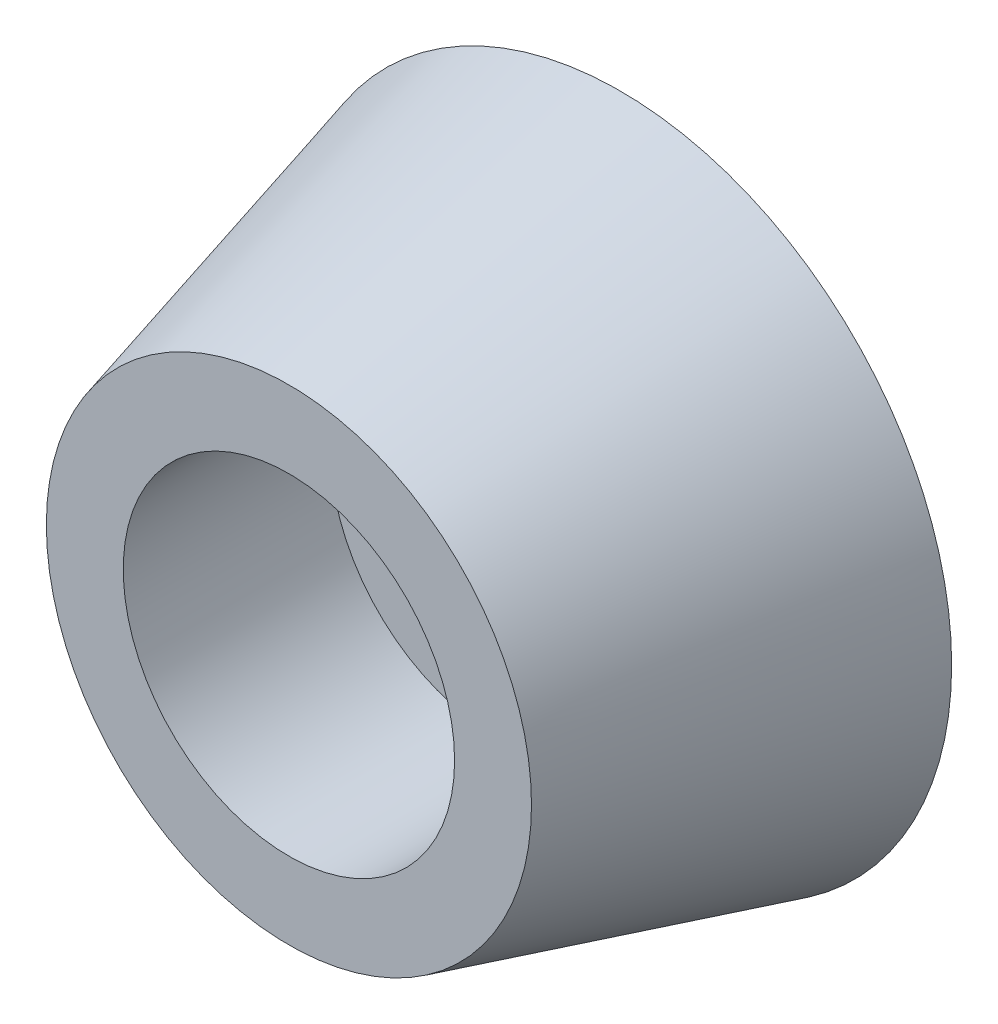
ISO-10303-21;
HEADER;
FILE_DESCRIPTION(('STEP AP214'),'2;1');
FILE_NAME('part.step','',(''),(''),'','','');
FILE_SCHEMA(('AUTOMOTIVE_DESIGN { 1 0 10303 214 1 1 1 1 }'));
ENDSEC;
DATA;
#1=APPLICATION_CONTEXT('core data for automotive mechanical design processes');
#2=APPLICATION_PROTOCOL_DEFINITION('international standard','automotive_design',2000,#1);
#3=PRODUCT_CONTEXT('',#1,'mechanical');
#4=PRODUCT('Part','Part','',(#3));
#5=PRODUCT_RELATED_PRODUCT_CATEGORY('part','',(#4));
#6=PRODUCT_DEFINITION_FORMATION('','',#4);
#7=PRODUCT_DEFINITION_CONTEXT('part definition',#1,'design');
#8=PRODUCT_DEFINITION('design','',#6,#7);
#9=PRODUCT_DEFINITION_SHAPE('','',#8);
#10=(LENGTH_UNIT() NAMED_UNIT(*) SI_UNIT(.MILLI.,.METRE.));
#11=(NAMED_UNIT(*) PLANE_ANGLE_UNIT() SI_UNIT($,.RADIAN.));
#12=(NAMED_UNIT(*) SI_UNIT($,.STERADIAN.) SOLID_ANGLE_UNIT());
#13=UNCERTAINTY_MEASURE_WITH_UNIT(LENGTH_MEASURE(1.E-05),#10,'distance_accuracy_value','');
#14=(GEOMETRIC_REPRESENTATION_CONTEXT(3) GLOBAL_UNCERTAINTY_ASSIGNED_CONTEXT((#13)) GLOBAL_UNIT_ASSIGNED_CONTEXT((#10,
#11,#12)) REPRESENTATION_CONTEXT('',''));
#15=CARTESIAN_POINT('',(0.,0.,0.));
#16=DIRECTION('',(0.,0.,1.));
#17=DIRECTION('',(1.,0.,0.));
#18=AXIS2_PLACEMENT_3D('',#15,#16,#17);
#19=CARTESIAN_POINT('',(0.,0.,0.));
#20=DIRECTION('',(0.,0.,-1.));
#21=DIRECTION('',(1.,0.,0.));
#22=AXIS2_PLACEMENT_3D('',#19,#20,#21);
#23=CONICAL_SURFACE('',#22,6.35,0.261799387799149);
#24=CARTESIAN_POINT('',(0.,0.,6.35));
#25=DIRECTION('',(0.,0.,1.));
#26=DIRECTION('',(1.,0.,0.));
#27=AXIS2_PLACEMENT_3D('',#24,#25,#26);
#28=CIRCLE('',#27,4.64852262806237);
#29=CARTESIAN_POINT('',(4.64852262806237,0.,6.35));
#30=VERTEX_POINT('',#29);
#31=EDGE_CURVE('E10',#30,#30,#28,.T.);
#32=ORIENTED_EDGE('',*,*,#31,.F.);
#33=EDGE_LOOP('',(#32));
#34=FACE_BOUND('',#33,.T.);
#35=CARTESIAN_POINT('',(0.,0.,0.));
#36=DIRECTION('',(0.,0.,1.));
#37=DIRECTION('',(1.,0.,0.));
#38=AXIS2_PLACEMENT_3D('',#35,#36,#37);
#39=CIRCLE('',#38,6.35);
#40=CARTESIAN_POINT('',(6.35,0.,0.));
#41=VERTEX_POINT('',#40);
#42=EDGE_CURVE('E38',#41,#41,#39,.T.);
#43=ORIENTED_EDGE('',*,*,#42,.T.);
#44=EDGE_LOOP('',(#43));
#45=FACE_BOUND('',#44,.T.);
#46=ADVANCED_FACE('F32',(#34,#45),#23,.T.);
#47=CARTESIAN_POINT('',(0.,0.,6.35));
#48=DIRECTION('',(0.,0.,1.));
#49=DIRECTION('',(1.,0.,0.));
#50=AXIS2_PLACEMENT_3D('',#47,#48,#49);
#51=PLANE('',#50);
#52=CARTESIAN_POINT('',(0.,0.,6.35));
#53=DIRECTION('',(0.,0.,1.));
#54=DIRECTION('',(1.,0.,0.));
#55=AXIS2_PLACEMENT_3D('',#52,#53,#54);
#56=CIRCLE('',#55,3.175);
#57=CARTESIAN_POINT('',(3.175,0.,6.35));
#58=VERTEX_POINT('',#57);
#59=EDGE_CURVE('E46',#58,#58,#56,.T.);
#60=ORIENTED_EDGE('',*,*,#59,.F.);
#61=EDGE_LOOP('',(#60));
#62=FACE_BOUND('',#61,.T.);
#63=ORIENTED_EDGE('',*,*,#31,.T.);
#64=EDGE_LOOP('',(#63));
#65=FACE_BOUND('',#64,.T.);
#66=ADVANCED_FACE('F79',(#62,#65),#51,.T.);
#67=CARTESIAN_POINT('',(0.,0.,0.));
#68=DIRECTION('',(0.,0.,1.));
#69=DIRECTION('',(1.,0.,0.));
#70=AXIS2_PLACEMENT_3D('',#67,#68,#69);
#71=PLANE('',#70);
#72=CARTESIAN_POINT('',(0.,0.,0.));
#73=DIRECTION('',(0.,0.,1.));
#74=DIRECTION('',(1.,0.,0.));
#75=AXIS2_PLACEMENT_3D('',#72,#73,#74);
#76=CIRCLE('',#75,1.5875);
#77=CARTESIAN_POINT('',(1.5875,0.,0.));
#78=VERTEX_POINT('',#77);
#79=EDGE_CURVE('E50',#78,#78,#76,.T.);
#80=ORIENTED_EDGE('',*,*,#79,.T.);
#81=EDGE_LOOP('',(#80));
#82=FACE_BOUND('',#81,.T.);
#83=ORIENTED_EDGE('',*,*,#42,.F.);
#84=EDGE_LOOP('',(#83));
#85=FACE_BOUND('',#84,.T.);
#86=ADVANCED_FACE('F58',(#82,#85),#71,.F.);
#87=CARTESIAN_POINT('',(0.,0.,2.38125));
#88=DIRECTION('',(0.,0.,1.));
#89=DIRECTION('',(1.,0.,0.));
#90=AXIS2_PLACEMENT_3D('',#87,#88,#89);
#91=CYLINDRICAL_SURFACE('',#90,3.175);
#92=CARTESIAN_POINT('',(0.,0.,2.38125));
#93=DIRECTION('',(0.,0.,1.));
#94=DIRECTION('',(1.,0.,0.));
#95=AXIS2_PLACEMENT_3D('',#92,#93,#94);
#96=CIRCLE('',#95,3.175);
#97=CARTESIAN_POINT('',(3.175,0.,2.38125));
#98=VERTEX_POINT('',#97);
#99=EDGE_CURVE('E42',#98,#98,#96,.T.);
#100=ORIENTED_EDGE('',*,*,#99,.F.);
#101=EDGE_LOOP('',(#100));
#102=FACE_BOUND('',#101,.T.);
#103=ORIENTED_EDGE('',*,*,#59,.T.);
#104=EDGE_LOOP('',(#103));
#105=FACE_BOUND('',#104,.T.);
#106=ADVANCED_FACE('F70',(#102,#105),#91,.F.);
#107=CARTESIAN_POINT('',(0.,0.,2.38125));
#108=DIRECTION('',(0.,0.,1.));
#109=DIRECTION('',(1.,0.,0.));
#110=AXIS2_PLACEMENT_3D('',#107,#108,#109);
#111=PLANE('',#110);
#112=CARTESIAN_POINT('',(0.,0.,2.38125));
#113=DIRECTION('',(0.,0.,1.));
#114=DIRECTION('',(1.,0.,0.));
#115=AXIS2_PLACEMENT_3D('',#112,#113,#114);
#116=CIRCLE('',#115,1.5875);
#117=CARTESIAN_POINT('',(1.5875,0.,2.38125));
#118=VERTEX_POINT('',#117);
#119=EDGE_CURVE('E52',#118,#118,#116,.T.);
#120=ORIENTED_EDGE('',*,*,#119,.F.);
#121=EDGE_LOOP('',(#120));
#122=FACE_BOUND('',#121,.T.);
#123=ORIENTED_EDGE('',*,*,#99,.T.);
#124=EDGE_LOOP('',(#123));
#125=FACE_BOUND('',#124,.T.);
#126=ADVANCED_FACE('F64',(#122,#125),#111,.T.);
#127=CARTESIAN_POINT('',(0.,0.,0.));
#128=DIRECTION('',(0.,0.,1.));
#129=DIRECTION('',(1.,0.,0.));
#130=AXIS2_PLACEMENT_3D('',#127,#128,#129);
#131=CYLINDRICAL_SURFACE('',#130,1.5875);
#132=ORIENTED_EDGE('',*,*,#79,.F.);
#133=EDGE_LOOP('',(#132));
#134=FACE_BOUND('',#133,.T.);
#135=ORIENTED_EDGE('',*,*,#119,.T.);
#136=EDGE_LOOP('',(#135));
#137=FACE_BOUND('',#136,.T.);
#138=ADVANCED_FACE('F61',(#134,#137),#131,.F.);
#139=CLOSED_SHELL('',(#46,#66,#86,#106,#126,#138));
#140=MANIFOLD_SOLID_BREP('B2',#139);
#141=ADVANCED_BREP_SHAPE_REPRESENTATION('',(#18,#140),#14);
#142=SHAPE_DEFINITION_REPRESENTATION(#9,#141);
ENDSEC;
END-ISO-10303-21;
